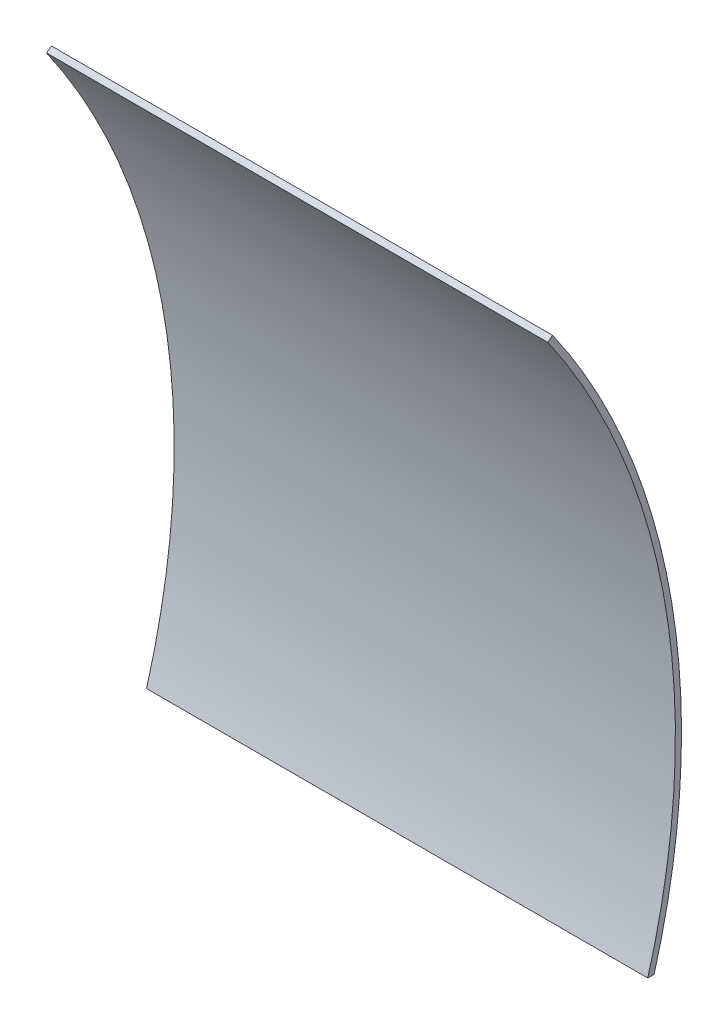
ISO-10303-21;
HEADER;
FILE_DESCRIPTION(('STEP AP214'),'2;1');
FILE_NAME('part.step','',(''),(''),'','','');
FILE_SCHEMA(('AUTOMOTIVE_DESIGN { 1 0 10303 214 1 1 1 1 }'));
ENDSEC;
DATA;
#1=APPLICATION_CONTEXT('core data for automotive mechanical design processes');
#2=APPLICATION_PROTOCOL_DEFINITION('international standard','automotive_design',2000,#1);
#3=PRODUCT_CONTEXT('',#1,'mechanical');
#4=PRODUCT('Part','Part','',(#3));
#5=PRODUCT_RELATED_PRODUCT_CATEGORY('part','',(#4));
#6=PRODUCT_DEFINITION_FORMATION('','',#4);
#7=PRODUCT_DEFINITION_CONTEXT('part definition',#1,'design');
#8=PRODUCT_DEFINITION('design','',#6,#7);
#9=PRODUCT_DEFINITION_SHAPE('','',#8);
#10=(LENGTH_UNIT() NAMED_UNIT(*) SI_UNIT(.MILLI.,.METRE.));
#11=(NAMED_UNIT(*) PLANE_ANGLE_UNIT() SI_UNIT($,.RADIAN.));
#12=(NAMED_UNIT(*) SI_UNIT($,.STERADIAN.) SOLID_ANGLE_UNIT());
#13=UNCERTAINTY_MEASURE_WITH_UNIT(LENGTH_MEASURE(1.E-05),#10,'distance_accuracy_value','');
#14=(GEOMETRIC_REPRESENTATION_CONTEXT(3) GLOBAL_UNCERTAINTY_ASSIGNED_CONTEXT((#13)) GLOBAL_UNIT_ASSIGNED_CONTEXT((#10,
#11,#12)) REPRESENTATION_CONTEXT('',''));
#15=CARTESIAN_POINT('',(0.,0.,0.));
#16=DIRECTION('',(0.,0.,1.));
#17=DIRECTION('',(1.,0.,0.));
#18=AXIS2_PLACEMENT_3D('',#15,#16,#17);
#19=CARTESIAN_POINT('',(130.175,-50.8,-176.178529946366));
#20=DIRECTION('',(0.,1.,0.));
#21=DIRECTION('',(0.,0.,1.));
#22=AXIS2_PLACEMENT_3D('',#19,#20,#21);
#23=PLANE('',#22);
#24=DIRECTION('',(0.,0.,-1.));
#25=VECTOR('',#24,1.);
#26=CARTESIAN_POINT('',(0.,-50.8,-176.178529946366));
#27=LINE('',#26,#25);
#28=CARTESIAN_POINT('',(0.,-50.8,-176.178529946366));
#29=VERTEX_POINT('',#28);
#30=CARTESIAN_POINT('',(0.,-50.8,-177.830117426893));
#31=VERTEX_POINT('',#30);
#32=EDGE_CURVE('E86',#29,#31,#27,.T.);
#33=ORIENTED_EDGE('',*,*,#32,.T.);
#34=DIRECTION('',(-1.,0.,0.));
#35=VECTOR('',#34,1.);
#36=CARTESIAN_POINT('',(130.175,-50.8,-177.830117426893));
#37=LINE('',#36,#35);
#38=CARTESIAN_POINT('',(130.175,-50.8,-177.830117426893));
#39=VERTEX_POINT('',#38);
#40=EDGE_CURVE('E40',#39,#31,#37,.T.);
#41=ORIENTED_EDGE('',*,*,#40,.F.);
#42=DIRECTION('',(0.,0.,-1.));
#43=VECTOR('',#42,1.);
#44=CARTESIAN_POINT('',(130.175,-50.8,-176.178529946366));
#45=LINE('',#44,#43);
#46=CARTESIAN_POINT('',(130.175,-50.8,-176.178529946366));
#47=VERTEX_POINT('',#46);
#48=EDGE_CURVE('E79',#47,#39,#45,.T.);
#49=ORIENTED_EDGE('',*,*,#48,.F.);
#50=DIRECTION('',(-1.,0.,0.));
#51=VECTOR('',#50,1.);
#52=CARTESIAN_POINT('',(130.175,-50.8,-176.178529946366));
#53=LINE('',#52,#51);
#54=EDGE_CURVE('E11',#47,#29,#53,.T.);
#55=ORIENTED_EDGE('',*,*,#54,.T.);
#56=EDGE_LOOP('',(#33,#41,#49,#55));
#57=FACE_BOUND('',#56,.T.);
#58=ADVANCED_FACE('F32',(#57),#23,.F.);
#59=CARTESIAN_POINT('',(130.175,0.,0.));
#60=DIRECTION('',(-1.,0.,0.));
#61=DIRECTION('',(0.,0.,1.));
#62=AXIS2_PLACEMENT_3D('',#59,#60,#61);
#63=CYLINDRICAL_SURFACE('',#62,184.94375);
#64=CARTESIAN_POINT('',(0.,0.,0.));
#65=DIRECTION('',(1.,0.,0.));
#66=DIRECTION('',(0.,0.,-1.));
#67=AXIS2_PLACEMENT_3D('',#64,#65,#66);
#68=CIRCLE('',#67,184.94375);
#69=CARTESIAN_POINT('',(0.,106.079377050399,-151.497050890972));
#70=VERTEX_POINT('',#69);
#71=EDGE_CURVE('E66',#31,#70,#68,.T.);
#72=ORIENTED_EDGE('',*,*,#71,.T.);
#73=DIRECTION('',(-1.,0.,0.));
#74=VECTOR('',#73,1.);
#75=CARTESIAN_POINT('',(130.175,106.079377050399,-151.497050890972));
#76=LINE('',#75,#74);
#77=CARTESIAN_POINT('',(130.175,106.079377050399,-151.497050890972));
#78=VERTEX_POINT('',#77);
#79=EDGE_CURVE('E87',#78,#70,#76,.T.);
#80=ORIENTED_EDGE('',*,*,#79,.F.);
#81=CARTESIAN_POINT('',(130.175,0.,0.));
#82=DIRECTION('',(1.,0.,0.));
#83=DIRECTION('',(0.,0.,-1.));
#84=AXIS2_PLACEMENT_3D('',#81,#82,#83);
#85=CIRCLE('',#84,184.94375);
#86=EDGE_CURVE('E83',#39,#78,#85,.T.);
#87=ORIENTED_EDGE('',*,*,#86,.F.);
#88=ORIENTED_EDGE('',*,*,#40,.T.);
#89=EDGE_LOOP('',(#72,#80,#87,#88));
#90=FACE_BOUND('',#89,.T.);
#91=ADVANCED_FACE('F88',(#90),#63,.T.);
#92=CARTESIAN_POINT('',(130.175,105.168824457692,-150.196647020663));
#93=DIRECTION('',(0.,-0.819152044288991,-0.573576436351047));
#94=DIRECTION('',(0.,0.573576436351047,-0.819152044288991));
#95=AXIS2_PLACEMENT_3D('',#92,#93,#94);
#96=PLANE('',#95);
#97=DIRECTION('',(0.,-0.573576436351047,0.819152044288991));
#98=VECTOR('',#97,1.);
#99=CARTESIAN_POINT('',(0.,105.168824457692,-150.196647020663));
#100=LINE('',#99,#98);
#101=CARTESIAN_POINT('',(0.,105.168824457692,-150.196647020663));
#102=VERTEX_POINT('',#101);
#103=EDGE_CURVE('E73',#70,#102,#100,.T.);
#104=ORIENTED_EDGE('',*,*,#103,.T.);
#105=DIRECTION('',(-1.,0.,0.));
#106=VECTOR('',#105,1.);
#107=CARTESIAN_POINT('',(130.175,105.168824457692,-150.196647020663));
#108=LINE('',#107,#106);
#109=CARTESIAN_POINT('',(130.175,105.168824457692,-150.196647020663));
#110=VERTEX_POINT('',#109);
#111=EDGE_CURVE('E92',#110,#102,#108,.T.);
#112=ORIENTED_EDGE('',*,*,#111,.F.);
#113=DIRECTION('',(0.,-0.573576436351047,0.819152044288991));
#114=VECTOR('',#113,1.);
#115=CARTESIAN_POINT('',(130.175,105.168824457692,-150.196647020663));
#116=LINE('',#115,#114);
#117=EDGE_CURVE('E90',#78,#110,#116,.T.);
#118=ORIENTED_EDGE('',*,*,#117,.F.);
#119=ORIENTED_EDGE('',*,*,#79,.T.);
#120=EDGE_LOOP('',(#104,#112,#118,#119));
#121=FACE_BOUND('',#120,.T.);
#122=ADVANCED_FACE('F102',(#121),#96,.F.);
#123=CARTESIAN_POINT('',(130.175,0.,0.));
#124=DIRECTION('',(-1.,0.,0.));
#125=DIRECTION('',(0.,0.,1.));
#126=AXIS2_PLACEMENT_3D('',#123,#124,#125);
#127=CYLINDRICAL_SURFACE('',#126,183.35625);
#128=CARTESIAN_POINT('',(0.,0.,0.));
#129=DIRECTION('',(-1.,0.,0.));
#130=DIRECTION('',(0.,0.,-1.));
#131=AXIS2_PLACEMENT_3D('',#128,#129,#130);
#132=CIRCLE('',#131,183.35625);
#133=EDGE_CURVE('E99',#102,#29,#132,.T.);
#134=ORIENTED_EDGE('',*,*,#133,.T.);
#135=ORIENTED_EDGE('',*,*,#54,.F.);
#136=CARTESIAN_POINT('',(130.175,0.,0.));
#137=DIRECTION('',(-1.,0.,0.));
#138=DIRECTION('',(0.,0.,1.));
#139=AXIS2_PLACEMENT_3D('',#136,#137,#138);
#140=CIRCLE('',#139,183.35625);
#141=EDGE_CURVE('E48',#110,#47,#140,.T.);
#142=ORIENTED_EDGE('',*,*,#141,.F.);
#143=ORIENTED_EDGE('',*,*,#111,.T.);
#144=EDGE_LOOP('',(#134,#135,#142,#143));
#145=FACE_BOUND('',#144,.T.);
#146=ADVANCED_FACE('F106',(#145),#127,.F.);
#147=CARTESIAN_POINT('',(130.175,0.,0.));
#148=DIRECTION('',(-1.,0.,0.));
#149=DIRECTION('',(0.,0.,1.));
#150=AXIS2_PLACEMENT_3D('',#147,#148,#149);
#151=PLANE('',#150);
#152=ORIENTED_EDGE('',*,*,#141,.T.);
#153=ORIENTED_EDGE('',*,*,#48,.T.);
#154=ORIENTED_EDGE('',*,*,#86,.T.);
#155=ORIENTED_EDGE('',*,*,#117,.T.);
#156=EDGE_LOOP('',(#152,#153,#154,#155));
#157=FACE_BOUND('',#156,.T.);
#158=ADVANCED_FACE('F81',(#157),#151,.F.);
#159=CARTESIAN_POINT('',(0.,0.,0.));
#160=DIRECTION('',(-1.,0.,0.));
#161=DIRECTION('',(0.,0.,1.));
#162=AXIS2_PLACEMENT_3D('',#159,#160,#161);
#163=PLANE('',#162);
#164=ORIENTED_EDGE('',*,*,#32,.F.);
#165=ORIENTED_EDGE('',*,*,#133,.F.);
#166=ORIENTED_EDGE('',*,*,#103,.F.);
#167=ORIENTED_EDGE('',*,*,#71,.F.);
#168=EDGE_LOOP('',(#164,#165,#166,#167));
#169=FACE_BOUND('',#168,.T.);
#170=ADVANCED_FACE('F105',(#169),#163,.T.);
#171=CLOSED_SHELL('',(#58,#91,#122,#146,#158,#170));
#172=MANIFOLD_SOLID_BREP('B2',#171);
#173=ADVANCED_BREP_SHAPE_REPRESENTATION('',(#18,#172),#14);
#174=SHAPE_DEFINITION_REPRESENTATION(#9,#173);
ENDSEC;
END-ISO-10303-21;
